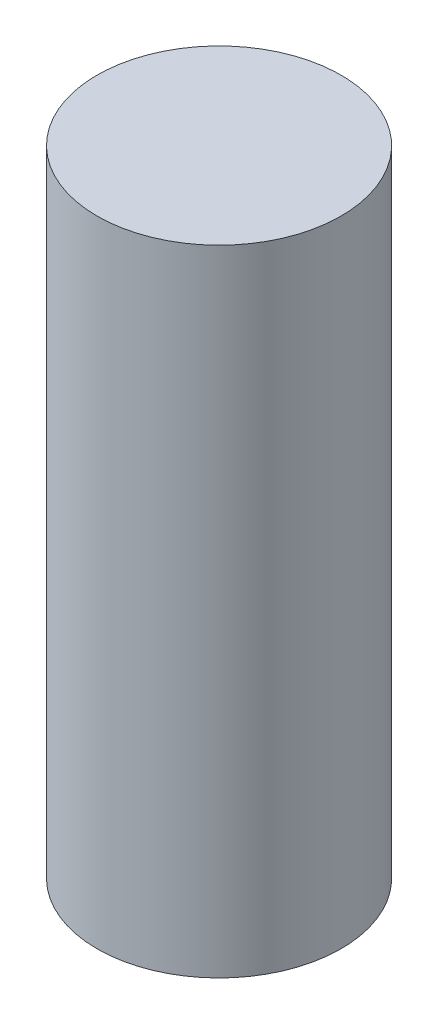
ISO-10303-21;
HEADER;
FILE_DESCRIPTION(('STEP AP214'),'2;1');
FILE_NAME('part.step','',(''),(''),'','','');
FILE_SCHEMA(('AUTOMOTIVE_DESIGN { 1 0 10303 214 1 1 1 1 }'));
ENDSEC;
DATA;
#1=APPLICATION_CONTEXT('core data for automotive mechanical design processes');
#2=APPLICATION_PROTOCOL_DEFINITION('international standard','automotive_design',2000,#1);
#3=PRODUCT_CONTEXT('',#1,'mechanical');
#4=PRODUCT('Part','Part','',(#3));
#5=PRODUCT_RELATED_PRODUCT_CATEGORY('part','',(#4));
#6=PRODUCT_DEFINITION_FORMATION('','',#4);
#7=PRODUCT_DEFINITION_CONTEXT('part definition',#1,'design');
#8=PRODUCT_DEFINITION('design','',#6,#7);
#9=PRODUCT_DEFINITION_SHAPE('','',#8);
#10=(LENGTH_UNIT() NAMED_UNIT(*) SI_UNIT(.MILLI.,.METRE.));
#11=(NAMED_UNIT(*) PLANE_ANGLE_UNIT() SI_UNIT($,.RADIAN.));
#12=(NAMED_UNIT(*) SI_UNIT($,.STERADIAN.) SOLID_ANGLE_UNIT());
#13=UNCERTAINTY_MEASURE_WITH_UNIT(LENGTH_MEASURE(1.E-05),#10,'distance_accuracy_value','');
#14=(GEOMETRIC_REPRESENTATION_CONTEXT(3) GLOBAL_UNCERTAINTY_ASSIGNED_CONTEXT((#13)) GLOBAL_UNIT_ASSIGNED_CONTEXT((#10,
#11,#12)) REPRESENTATION_CONTEXT('',''));
#15=CARTESIAN_POINT('',(0.,0.,0.));
#16=DIRECTION('',(0.,0.,1.));
#17=DIRECTION('',(1.,0.,0.));
#18=AXIS2_PLACEMENT_3D('',#15,#16,#17);
#19=CARTESIAN_POINT('',(0.,2.6,0.));
#20=DIRECTION('',(0.,-1.,0.));
#21=DIRECTION('',(0.,0.,-1.));
#22=AXIS2_PLACEMENT_3D('',#19,#20,#21);
#23=CYLINDRICAL_SURFACE('',#22,0.5);
#24=CARTESIAN_POINT('',(0.,2.6,0.));
#25=DIRECTION('',(0.,1.,0.));
#26=DIRECTION('',(0.,0.,1.));
#27=AXIS2_PLACEMENT_3D('',#24,#25,#26);
#28=CIRCLE('',#27,0.5);
#29=CARTESIAN_POINT('',(0.,2.6,0.5));
#30=VERTEX_POINT('',#29);
#31=EDGE_CURVE('E10',#30,#30,#28,.T.);
#32=ORIENTED_EDGE('',*,*,#31,.F.);
#33=EDGE_LOOP('',(#32));
#34=FACE_BOUND('',#33,.T.);
#35=CARTESIAN_POINT('',(0.,0.,0.));
#36=DIRECTION('',(0.,1.,0.));
#37=DIRECTION('',(0.,0.,1.));
#38=AXIS2_PLACEMENT_3D('',#35,#36,#37);
#39=CIRCLE('',#38,0.5);
#40=CARTESIAN_POINT('',(0.,0.,0.5));
#41=VERTEX_POINT('',#40);
#42=EDGE_CURVE('E31',#41,#41,#39,.T.);
#43=ORIENTED_EDGE('',*,*,#42,.T.);
#44=EDGE_LOOP('',(#43));
#45=FACE_BOUND('',#44,.T.);
#46=ADVANCED_FACE('F28',(#34,#45),#23,.T.);
#47=CARTESIAN_POINT('',(0.,2.6,0.));
#48=DIRECTION('',(0.,1.,0.));
#49=DIRECTION('',(0.,0.,1.));
#50=AXIS2_PLACEMENT_3D('',#47,#48,#49);
#51=PLANE('',#50);
#52=ORIENTED_EDGE('',*,*,#31,.T.);
#53=EDGE_LOOP('',(#52));
#54=FACE_BOUND('',#53,.T.);
#55=ADVANCED_FACE('F43',(#54),#51,.T.);
#56=CARTESIAN_POINT('',(0.,0.,0.));
#57=DIRECTION('',(0.,1.,0.));
#58=DIRECTION('',(0.,0.,1.));
#59=AXIS2_PLACEMENT_3D('',#56,#57,#58);
#60=PLANE('',#59);
#61=ORIENTED_EDGE('',*,*,#42,.F.);
#62=EDGE_LOOP('',(#61));
#63=FACE_BOUND('',#62,.T.);
#64=ADVANCED_FACE('F41',(#63),#60,.F.);
#65=CLOSED_SHELL('',(#46,#55,#64));
#66=MANIFOLD_SOLID_BREP('B2',#65);
#67=ADVANCED_BREP_SHAPE_REPRESENTATION('',(#18,#66),#14);
#68=SHAPE_DEFINITION_REPRESENTATION(#9,#67);
ENDSEC;
END-ISO-10303-21;
